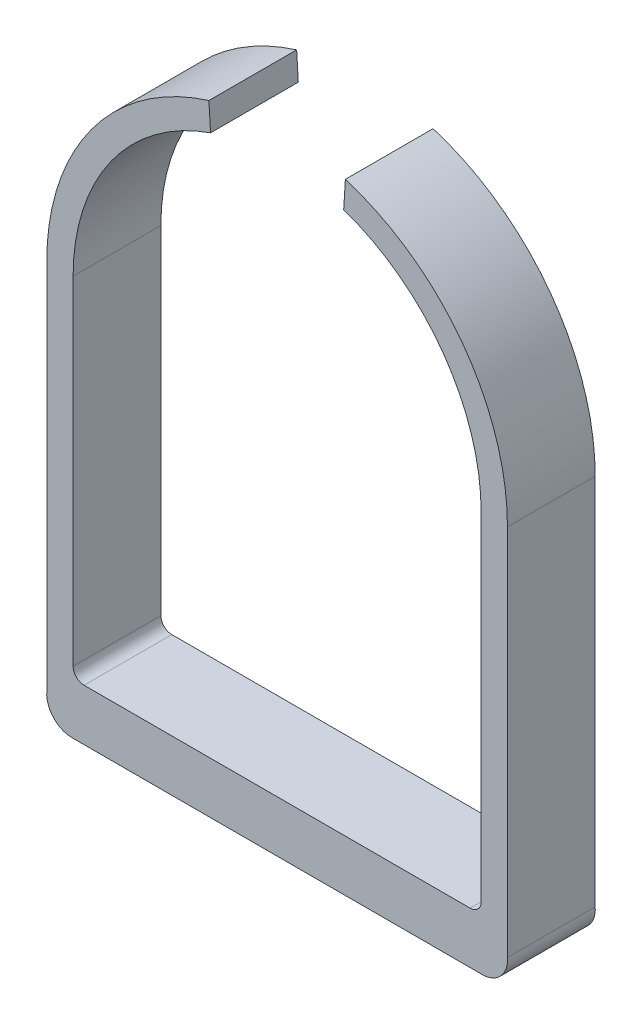
ISO-10303-21;
HEADER;
FILE_DESCRIPTION(('STEP AP214'),'2;1');
FILE_NAME('part.step','',(''),(''),'','','');
FILE_SCHEMA(('AUTOMOTIVE_DESIGN { 1 0 10303 214 1 1 1 1 }'));
ENDSEC;
DATA;
#1=APPLICATION_CONTEXT('core data for automotive mechanical design processes');
#2=APPLICATION_PROTOCOL_DEFINITION('international standard','automotive_design',2000,#1);
#3=PRODUCT_CONTEXT('',#1,'mechanical');
#4=PRODUCT('Part','Part','',(#3));
#5=PRODUCT_RELATED_PRODUCT_CATEGORY('part','',(#4));
#6=PRODUCT_DEFINITION_FORMATION('','',#4);
#7=PRODUCT_DEFINITION_CONTEXT('part definition',#1,'design');
#8=PRODUCT_DEFINITION('design','',#6,#7);
#9=PRODUCT_DEFINITION_SHAPE('','',#8);
#10=(LENGTH_UNIT() NAMED_UNIT(*) SI_UNIT(.MILLI.,.METRE.));
#11=(NAMED_UNIT(*) PLANE_ANGLE_UNIT() SI_UNIT($,.RADIAN.));
#12=(NAMED_UNIT(*) SI_UNIT($,.STERADIAN.) SOLID_ANGLE_UNIT());
#13=UNCERTAINTY_MEASURE_WITH_UNIT(LENGTH_MEASURE(1.E-05),#10,'distance_accuracy_value','');
#14=(GEOMETRIC_REPRESENTATION_CONTEXT(3) GLOBAL_UNCERTAINTY_ASSIGNED_CONTEXT((#13)) GLOBAL_UNIT_ASSIGNED_CONTEXT((#10,
#11,#12)) REPRESENTATION_CONTEXT('',''));
#15=CARTESIAN_POINT('',(0.,0.,0.));
#16=DIRECTION('',(0.,0.,1.));
#17=DIRECTION('',(1.,0.,0.));
#18=AXIS2_PLACEMENT_3D('',#15,#16,#17);
#19=CARTESIAN_POINT('',(0.,0.,56.8469714478884));
#20=DIRECTION('',(0.,0.,-1.));
#21=DIRECTION('',(-1.,0.,0.));
#22=AXIS2_PLACEMENT_3D('',#19,#20,#21);
#23=CYLINDRICAL_SURFACE('',#22,9.3);
#24=DIRECTION('',(0.,0.,-1.));
#25=VECTOR('',#24,1.);
#26=CARTESIAN_POINT('',(3.03467311666204,8.79094756411439,56.8469714478884));
#27=LINE('',#26,#25);
#28=CARTESIAN_POINT('',(3.03467311666204,8.79094756411439,1.5));
#29=VERTEX_POINT('',#28);
#30=CARTESIAN_POINT('',(3.03467311666204,8.79094756411439,5.5));
#31=VERTEX_POINT('',#30);
#32=EDGE_CURVE('E231',#29,#31,#27,.F.);
#33=ORIENTED_EDGE('',*,*,#32,.F.);
#34=CARTESIAN_POINT('',(0.,0.,1.5));
#35=DIRECTION('',(0.,0.,1.));
#36=DIRECTION('',(-1.,0.,0.));
#37=AXIS2_PLACEMENT_3D('',#34,#35,#36);
#38=CIRCLE('',#37,9.3);
#39=CARTESIAN_POINT('',(9.3,0.,1.5));
#40=VERTEX_POINT('',#39);
#41=EDGE_CURVE('E220',#40,#29,#38,.T.);
#42=ORIENTED_EDGE('',*,*,#41,.F.);
#43=DIRECTION('',(0.,0.,-1.));
#44=VECTOR('',#43,1.);
#45=CARTESIAN_POINT('',(9.3,0.,56.8469714478884));
#46=LINE('',#45,#44);
#47=CARTESIAN_POINT('',(9.3,0.,5.5));
#48=VERTEX_POINT('',#47);
#49=EDGE_CURVE('E11',#48,#40,#46,.T.);
#50=ORIENTED_EDGE('',*,*,#49,.F.);
#51=CARTESIAN_POINT('',(0.,0.,5.5));
#52=DIRECTION('',(0.,0.,1.));
#53=DIRECTION('',(1.,0.,0.));
#54=AXIS2_PLACEMENT_3D('',#51,#52,#53);
#55=CIRCLE('',#54,9.3);
#56=EDGE_CURVE('E243',#48,#31,#55,.T.);
#57=ORIENTED_EDGE('',*,*,#56,.T.);
#58=EDGE_LOOP('',(#33,#42,#50,#57));
#59=FACE_BOUND('',#58,.T.);
#60=ADVANCED_FACE('F48',(#59),#23,.F.);
#61=CARTESIAN_POINT('',(0.,0.,5.5));
#62=DIRECTION('',(0.,0.,1.));
#63=DIRECTION('',(1.,0.,0.));
#64=AXIS2_PLACEMENT_3D('',#61,#62,#63);
#65=PLANE('',#64);
#66=CARTESIAN_POINT('',(-9.34999999981468,-17.0923044273072,5.5));
#67=DIRECTION('',(0.,0.,1.));
#68=DIRECTION('',(1.,0.,0.));
#69=AXIS2_PLACEMENT_3D('',#66,#67,#68);
#70=CIRCLE('',#69,1.1536984474839);
#71=CARTESIAN_POINT('',(-9.34999999981468,-18.2460028747911,5.5));
#72=VERTEX_POINT('',#71);
#73=CARTESIAN_POINT('',(-10.5,-17.,5.5));
#74=VERTEX_POINT('',#73);
#75=EDGE_CURVE('E246',#72,#74,#70,.F.);
#76=ORIENTED_EDGE('',*,*,#75,.F.);
#77=DIRECTION('',(1.,0.,0.));
#78=VECTOR('',#77,1.);
#79=CARTESIAN_POINT('',(0.,-18.2460028747911,5.5));
#80=LINE('',#79,#78);
#81=CARTESIAN_POINT('',(9.35000000018532,-18.2460028747911,5.5));
#82=VERTEX_POINT('',#81);
#83=EDGE_CURVE('E261',#72,#82,#80,.T.);
#84=ORIENTED_EDGE('',*,*,#83,.T.);
#85=CARTESIAN_POINT('',(9.35000000018532,-17.0923044276493,5.5));
#86=DIRECTION('',(0.,0.,1.));
#87=DIRECTION('',(1.,0.,0.));
#88=AXIS2_PLACEMENT_3D('',#85,#86,#87);
#89=CIRCLE('',#88,1.15369844714181);
#90=CARTESIAN_POINT('',(10.5,-17.,5.5));
#91=VERTEX_POINT('',#90);
#92=EDGE_CURVE('E168',#82,#91,#89,.T.);
#93=ORIENTED_EDGE('',*,*,#92,.T.);
#94=DIRECTION('',(0.,-1.,0.));
#95=VECTOR('',#94,1.);
#96=CARTESIAN_POINT('',(10.5,0.,5.5));
#97=LINE('',#96,#95);
#98=CARTESIAN_POINT('',(10.5,0.,5.5));
#99=VERTEX_POINT('',#98);
#100=EDGE_CURVE('E248',#99,#91,#97,.T.);
#101=ORIENTED_EDGE('',*,*,#100,.F.);
#102=CARTESIAN_POINT('',(0.,0.,5.5));
#103=DIRECTION('',(0.,0.,1.));
#104=DIRECTION('',(1.,0.,0.));
#105=AXIS2_PLACEMENT_3D('',#102,#103,#104);
#106=CIRCLE('',#105,10.5);
#107=CARTESIAN_POINT('',(3.11032664956738,10.0287520725657,5.5));
#108=VERTEX_POINT('',#107);
#109=EDGE_CURVE('E250',#108,#99,#106,.F.);
#110=ORIENTED_EDGE('',*,*,#109,.F.);
#111=DIRECTION('',(-0.0610052906976046,-0.998137442693591,0.));
#112=VECTOR('',#111,1.);
#113=CARTESIAN_POINT('',(2.48808370636675,-0.15206950796001,5.5));
#114=LINE('',#113,#112);
#115=EDGE_CURVE('E256',#108,#31,#114,.T.);
#116=ORIENTED_EDGE('',*,*,#115,.T.);
#117=ORIENTED_EDGE('',*,*,#56,.F.);
#118=DIRECTION('',(0.,1.,0.));
#119=VECTOR('',#118,1.);
#120=CARTESIAN_POINT('',(9.3,0.,5.5));
#121=LINE('',#120,#119);
#122=CARTESIAN_POINT('',(9.3,-15.4,5.5));
#123=VERTEX_POINT('',#122);
#124=EDGE_CURVE('E70',#123,#48,#121,.T.);
#125=ORIENTED_EDGE('',*,*,#124,.F.);
#126=CARTESIAN_POINT('',(8.8,-15.4,5.5));
#127=DIRECTION('',(0.,0.,1.));
#128=DIRECTION('',(1.,0.,0.));
#129=AXIS2_PLACEMENT_3D('',#126,#127,#128);
#130=CIRCLE('',#129,0.5);
#131=CARTESIAN_POINT('',(8.8,-15.9,5.5));
#132=VERTEX_POINT('',#131);
#133=EDGE_CURVE('E267',#123,#132,#130,.F.);
#134=ORIENTED_EDGE('',*,*,#133,.T.);
#135=DIRECTION('',(1.,0.,0.));
#136=VECTOR('',#135,1.);
#137=CARTESIAN_POINT('',(0.,-15.9,5.5));
#138=LINE('',#137,#136);
#139=CARTESIAN_POINT('',(-8.8,-15.9,5.5));
#140=VERTEX_POINT('',#139);
#141=EDGE_CURVE('E239',#140,#132,#138,.T.);
#142=ORIENTED_EDGE('',*,*,#141,.F.);
#143=CARTESIAN_POINT('',(-8.8,-15.4,5.5));
#144=DIRECTION('',(0.,0.,1.));
#145=DIRECTION('',(1.,0.,0.));
#146=AXIS2_PLACEMENT_3D('',#143,#144,#145);
#147=CIRCLE('',#146,0.5);
#148=CARTESIAN_POINT('',(-9.3,-15.4,5.5));
#149=VERTEX_POINT('',#148);
#150=EDGE_CURVE('E234',#140,#149,#147,.F.);
#151=ORIENTED_EDGE('',*,*,#150,.T.);
#152=DIRECTION('',(0.,-1.,0.));
#153=VECTOR('',#152,1.);
#154=CARTESIAN_POINT('',(-9.3,-15.9,5.5));
#155=LINE('',#154,#153);
#156=CARTESIAN_POINT('',(-9.3,0.,5.5));
#157=VERTEX_POINT('',#156);
#158=EDGE_CURVE('E235',#157,#149,#155,.T.);
#159=ORIENTED_EDGE('',*,*,#158,.F.);
#160=CARTESIAN_POINT('',(-3.03467311644218,8.79094756419029,5.5));
#161=VERTEX_POINT('',#160);
#162=EDGE_CURVE('E63',#161,#157,#55,.T.);
#163=ORIENTED_EDGE('',*,*,#162,.F.);
#164=DIRECTION('',(-0.0610052909139107,0.99813744268037,0.));
#165=VECTOR('',#164,1.);
#166=CARTESIAN_POINT('',(-2.48808370417207,-0.152069508367079,5.5));
#167=LINE('',#166,#165);
#168=CARTESIAN_POINT('',(-3.11032664961128,10.0287520725521,5.5));
#169=VERTEX_POINT('',#168);
#170=EDGE_CURVE('E258',#161,#169,#167,.T.);
#171=ORIENTED_EDGE('',*,*,#170,.T.);
#172=CARTESIAN_POINT('',(0.,0.,5.5));
#173=DIRECTION('',(0.,0.,1.));
#174=DIRECTION('',(1.,0.,0.));
#175=AXIS2_PLACEMENT_3D('',#172,#173,#174);
#176=CIRCLE('',#175,10.5);
#177=CARTESIAN_POINT('',(-10.5,0.,5.5));
#178=VERTEX_POINT('',#177);
#179=EDGE_CURVE('E253',#178,#169,#176,.F.);
#180=ORIENTED_EDGE('',*,*,#179,.F.);
#181=DIRECTION('',(0.,-1.,0.));
#182=VECTOR('',#181,1.);
#183=CARTESIAN_POINT('',(-10.5,0.,5.5));
#184=LINE('',#183,#182);
#185=EDGE_CURVE('E264',#178,#74,#184,.T.);
#186=ORIENTED_EDGE('',*,*,#185,.T.);
#187=EDGE_LOOP('',(#76,#84,#93,#101,#110,#116,#117,#125,#134,#142,#151,#159,#163,#171,#180,#186));
#188=FACE_BOUND('',#187,.T.);
#189=ADVANCED_FACE('F325',(#188),#65,.T.);
#190=DIRECTION('',(0.,0.,-1.));
#191=VECTOR('',#190,1.);
#192=CARTESIAN_POINT('',(-3.03467311644218,8.79094756419029,56.8469714478884));
#193=LINE('',#192,#191);
#194=CARTESIAN_POINT('',(-3.03467311644218,8.79094756419029,1.5));
#195=VERTEX_POINT('',#194);
#196=EDGE_CURVE('E229',#161,#195,#193,.T.);
#197=ORIENTED_EDGE('',*,*,#196,.F.);
#198=ORIENTED_EDGE('',*,*,#162,.T.);
#199=DIRECTION('',(0.,0.,-1.));
#200=VECTOR('',#199,1.);
#201=CARTESIAN_POINT('',(-9.3,0.,56.8469714478884));
#202=LINE('',#201,#200);
#203=CARTESIAN_POINT('',(-9.3,0.,1.5));
#204=VERTEX_POINT('',#203);
#205=EDGE_CURVE('E56',#157,#204,#202,.T.);
#206=ORIENTED_EDGE('',*,*,#205,.T.);
#207=CARTESIAN_POINT('',(0.,0.,1.5));
#208=DIRECTION('',(0.,0.,1.));
#209=DIRECTION('',(-1.,0.,0.));
#210=AXIS2_PLACEMENT_3D('',#207,#208,#209);
#211=CIRCLE('',#210,9.3);
#212=EDGE_CURVE('E202',#195,#204,#211,.T.);
#213=ORIENTED_EDGE('',*,*,#212,.F.);
#214=EDGE_LOOP('',(#197,#198,#206,#213));
#215=FACE_BOUND('',#214,.T.);
#216=ADVANCED_FACE('F291',(#215),#23,.F.);
#217=CARTESIAN_POINT('',(-9.3,-15.9,56.8469714478884));
#218=DIRECTION('',(1.,0.,0.));
#219=DIRECTION('',(0.,0.,-1.));
#220=AXIS2_PLACEMENT_3D('',#217,#218,#219);
#221=PLANE('',#220);
#222=DIRECTION('',(0.,0.,-1.));
#223=VECTOR('',#222,1.);
#224=CARTESIAN_POINT('',(-9.3,-15.4,0.));
#225=LINE('',#224,#223);
#226=CARTESIAN_POINT('',(-9.3,-15.4,1.5));
#227=VERTEX_POINT('',#226);
#228=EDGE_CURVE('E238',#149,#227,#225,.T.);
#229=ORIENTED_EDGE('',*,*,#228,.T.);
#230=DIRECTION('',(0.,-1.,0.));
#231=VECTOR('',#230,1.);
#232=CARTESIAN_POINT('',(-9.3,0.,1.5));
#233=LINE('',#232,#231);
#234=EDGE_CURVE('E205',#204,#227,#233,.T.);
#235=ORIENTED_EDGE('',*,*,#234,.F.);
#236=ORIENTED_EDGE('',*,*,#205,.F.);
#237=ORIENTED_EDGE('',*,*,#158,.T.);
#238=EDGE_LOOP('',(#229,#235,#236,#237));
#239=FACE_BOUND('',#238,.T.);
#240=ADVANCED_FACE('F296',(#239),#221,.T.);
#241=CARTESIAN_POINT('',(0.,-15.9,56.8469714478884));
#242=DIRECTION('',(0.,1.,0.));
#243=DIRECTION('',(0.,0.,1.));
#244=AXIS2_PLACEMENT_3D('',#241,#242,#243);
#245=PLANE('',#244);
#246=DIRECTION('',(0.,0.,-1.));
#247=VECTOR('',#246,1.);
#248=CARTESIAN_POINT('',(8.8,-15.9,0.));
#249=LINE('',#248,#247);
#250=CARTESIAN_POINT('',(8.8,-15.9,1.5));
#251=VERTEX_POINT('',#250);
#252=EDGE_CURVE('E275',#132,#251,#249,.T.);
#253=ORIENTED_EDGE('',*,*,#252,.T.);
#254=DIRECTION('',(1.,0.,0.));
#255=VECTOR('',#254,1.);
#256=CARTESIAN_POINT('',(-8.8,-15.9,1.5));
#257=LINE('',#256,#255);
#258=CARTESIAN_POINT('',(-8.8,-15.9,1.5));
#259=VERTEX_POINT('',#258);
#260=EDGE_CURVE('E211',#259,#251,#257,.T.);
#261=ORIENTED_EDGE('',*,*,#260,.F.);
#262=DIRECTION('',(0.,0.,-1.));
#263=VECTOR('',#262,1.);
#264=CARTESIAN_POINT('',(-8.8,-15.9,6.02159565602451));
#265=LINE('',#264,#263);
#266=EDGE_CURVE('E173',#259,#140,#265,.F.);
#267=ORIENTED_EDGE('',*,*,#266,.T.);
#268=ORIENTED_EDGE('',*,*,#141,.T.);
#269=EDGE_LOOP('',(#253,#261,#267,#268));
#270=FACE_BOUND('',#269,.T.);
#271=ADVANCED_FACE('F303',(#270),#245,.T.);
#272=CARTESIAN_POINT('',(-8.8,-15.4,56.8469714478884));
#273=DIRECTION('',(0.,0.,1.));
#274=DIRECTION('',(1.,0.,0.));
#275=AXIS2_PLACEMENT_3D('',#272,#273,#274);
#276=CYLINDRICAL_SURFACE('',#275,0.5);
#277=ORIENTED_EDGE('',*,*,#266,.F.);
#278=CARTESIAN_POINT('',(-8.8,-15.4,1.5));
#279=DIRECTION('',(0.,0.,1.));
#280=DIRECTION('',(-1.,0.,0.));
#281=AXIS2_PLACEMENT_3D('',#278,#279,#280);
#282=CIRCLE('',#281,0.5);
#283=EDGE_CURVE('E208',#227,#259,#282,.T.);
#284=ORIENTED_EDGE('',*,*,#283,.F.);
#285=ORIENTED_EDGE('',*,*,#228,.F.);
#286=ORIENTED_EDGE('',*,*,#150,.F.);
#287=EDGE_LOOP('',(#277,#284,#285,#286));
#288=FACE_BOUND('',#287,.T.);
#289=ADVANCED_FACE('F299',(#288),#276,.F.);
#290=CARTESIAN_POINT('',(9.3,0.,56.8469714478884));
#291=DIRECTION('',(-1.,0.,0.));
#292=DIRECTION('',(0.,-1.,0.));
#293=AXIS2_PLACEMENT_3D('',#290,#291,#292);
#294=PLANE('',#293);
#295=ORIENTED_EDGE('',*,*,#49,.T.);
#296=DIRECTION('',(0.,1.,0.));
#297=VECTOR('',#296,1.);
#298=CARTESIAN_POINT('',(9.3,-15.4,1.5));
#299=LINE('',#298,#297);
#300=CARTESIAN_POINT('',(9.3,-15.4,1.5));
#301=VERTEX_POINT('',#300);
#302=EDGE_CURVE('E217',#301,#40,#299,.T.);
#303=ORIENTED_EDGE('',*,*,#302,.F.);
#304=DIRECTION('',(0.,0.,-1.));
#305=VECTOR('',#304,1.);
#306=CARTESIAN_POINT('',(9.3,-15.4,6.0215956560245));
#307=LINE('',#306,#305);
#308=EDGE_CURVE('E273',#301,#123,#307,.F.);
#309=ORIENTED_EDGE('',*,*,#308,.T.);
#310=ORIENTED_EDGE('',*,*,#124,.T.);
#311=EDGE_LOOP('',(#295,#303,#309,#310));
#312=FACE_BOUND('',#311,.T.);
#313=ADVANCED_FACE('F310',(#312),#294,.T.);
#314=CARTESIAN_POINT('',(8.8,-15.4,56.8469714478884));
#315=DIRECTION('',(0.,0.,1.));
#316=DIRECTION('',(1.,0.,0.));
#317=AXIS2_PLACEMENT_3D('',#314,#315,#316);
#318=CYLINDRICAL_SURFACE('',#317,0.5);
#319=ORIENTED_EDGE('',*,*,#308,.F.);
#320=CARTESIAN_POINT('',(8.8,-15.4,1.5));
#321=DIRECTION('',(0.,0.,1.));
#322=DIRECTION('',(-1.,0.,0.));
#323=AXIS2_PLACEMENT_3D('',#320,#321,#322);
#324=CIRCLE('',#323,0.5);
#325=EDGE_CURVE('E214',#251,#301,#324,.T.);
#326=ORIENTED_EDGE('',*,*,#325,.F.);
#327=ORIENTED_EDGE('',*,*,#252,.F.);
#328=ORIENTED_EDGE('',*,*,#133,.F.);
#329=EDGE_LOOP('',(#319,#326,#327,#328));
#330=FACE_BOUND('',#329,.T.);
#331=ADVANCED_FACE('F307',(#330),#318,.F.);
#332=CARTESIAN_POINT('',(2.48808370636675,-0.15206950796001,7.65));
#333=DIRECTION('',(0.998137442693591,-0.0610052906976046,0.));
#334=DIRECTION('',(0.0610052906976046,0.998137442693591,0.));
#335=AXIS2_PLACEMENT_3D('',#332,#333,#334);
#336=PLANE('',#335);
#337=DIRECTION('',(0.,0.,-1.));
#338=VECTOR('',#337,1.);
#339=CARTESIAN_POINT('',(3.11032664956738,10.0287520725657,7.65));
#340=LINE('',#339,#338);
#341=CARTESIAN_POINT('',(3.11032664956738,10.0287520725657,1.5));
#342=VERTEX_POINT('',#341);
#343=EDGE_CURVE('E281',#108,#342,#340,.T.);
#344=ORIENTED_EDGE('',*,*,#343,.T.);
#345=DIRECTION('',(0.0610052906976045,0.998137442693591,0.));
#346=VECTOR('',#345,1.);
#347=CARTESIAN_POINT('',(3.03467311666204,8.79094756411439,1.5));
#348=LINE('',#347,#346);
#349=EDGE_CURVE('E223',#29,#342,#348,.T.);
#350=ORIENTED_EDGE('',*,*,#349,.F.);
#351=ORIENTED_EDGE('',*,*,#32,.T.);
#352=ORIENTED_EDGE('',*,*,#115,.F.);
#353=EDGE_LOOP('',(#344,#350,#351,#352));
#354=FACE_BOUND('',#353,.T.);
#355=ADVANCED_FACE('F316',(#354),#336,.F.);
#356=CARTESIAN_POINT('',(0.,0.,7.65));
#357=DIRECTION('',(0.,0.,-1.));
#358=DIRECTION('',(-1.,0.,0.));
#359=AXIS2_PLACEMENT_3D('',#356,#357,#358);
#360=CYLINDRICAL_SURFACE('',#359,10.5);
#361=DIRECTION('',(0.,0.,-1.));
#362=VECTOR('',#361,1.);
#363=CARTESIAN_POINT('',(-3.11032664961128,10.0287520725521,7.65));
#364=LINE('',#363,#362);
#365=CARTESIAN_POINT('',(-3.11032664961128,10.0287520725521,1.5));
#366=VERTEX_POINT('',#365);
#367=EDGE_CURVE('E283',#169,#366,#364,.T.);
#368=ORIENTED_EDGE('',*,*,#367,.T.);
#369=CARTESIAN_POINT('',(0.,0.,1.5));
#370=DIRECTION('',(0.,0.,-1.));
#371=DIRECTION('',(-1.,0.,0.));
#372=AXIS2_PLACEMENT_3D('',#369,#370,#371);
#373=CIRCLE('',#372,10.5);
#374=CARTESIAN_POINT('',(-10.5,0.,1.5));
#375=VERTEX_POINT('',#374);
#376=EDGE_CURVE('E196',#375,#366,#373,.T.);
#377=ORIENTED_EDGE('',*,*,#376,.F.);
#378=DIRECTION('',(0.,0.,-1.));
#379=VECTOR('',#378,1.);
#380=CARTESIAN_POINT('',(-10.5,0.,7.65));
#381=LINE('',#380,#379);
#382=EDGE_CURVE('E285',#178,#375,#381,.T.);
#383=ORIENTED_EDGE('',*,*,#382,.F.);
#384=ORIENTED_EDGE('',*,*,#179,.T.);
#385=EDGE_LOOP('',(#368,#377,#383,#384));
#386=FACE_BOUND('',#385,.T.);
#387=ADVANCED_FACE('F336',(#386),#360,.T.);
#388=CARTESIAN_POINT('',(-10.5,0.,7.65));
#389=DIRECTION('',(1.,0.,0.));
#390=DIRECTION('',(0.,0.,-1.));
#391=AXIS2_PLACEMENT_3D('',#388,#389,#390);
#392=PLANE('',#391);
#393=ORIENTED_EDGE('',*,*,#382,.T.);
#394=DIRECTION('',(0.,1.,0.));
#395=VECTOR('',#394,1.);
#396=CARTESIAN_POINT('',(-10.5,-17.,1.5));
#397=LINE('',#396,#395);
#398=CARTESIAN_POINT('',(-10.5,-17.,1.5));
#399=VERTEX_POINT('',#398);
#400=EDGE_CURVE('E193',#399,#375,#397,.T.);
#401=ORIENTED_EDGE('',*,*,#400,.F.);
#402=DIRECTION('',(0.,0.,-1.));
#403=VECTOR('',#402,1.);
#404=CARTESIAN_POINT('',(-10.5,-17.,7.65));
#405=LINE('',#404,#403);
#406=EDGE_CURVE('E287',#74,#399,#405,.T.);
#407=ORIENTED_EDGE('',*,*,#406,.F.);
#408=ORIENTED_EDGE('',*,*,#185,.F.);
#409=EDGE_LOOP('',(#393,#401,#407,#408));
#410=FACE_BOUND('',#409,.T.);
#411=ADVANCED_FACE('F332',(#410),#392,.F.);
#412=CARTESIAN_POINT('',(0.,-18.2460028747911,7.65));
#413=DIRECTION('',(0.,1.,0.));
#414=DIRECTION('',(0.,0.,1.));
#415=AXIS2_PLACEMENT_3D('',#412,#413,#414);
#416=PLANE('',#415);
#417=DIRECTION('',(0.,0.,-1.));
#418=VECTOR('',#417,1.);
#419=CARTESIAN_POINT('',(-9.34999999981468,-18.2460028747911,7.65));
#420=LINE('',#419,#418);
#421=CARTESIAN_POINT('',(-9.34999999981468,-18.2460028747911,1.5));
#422=VERTEX_POINT('',#421);
#423=EDGE_CURVE('E179',#72,#422,#420,.T.);
#424=ORIENTED_EDGE('',*,*,#423,.T.);
#425=DIRECTION('',(-1.,0.,0.));
#426=VECTOR('',#425,1.);
#427=CARTESIAN_POINT('',(9.35000000018532,-18.2460028747911,1.5));
#428=LINE('',#427,#426);
#429=CARTESIAN_POINT('',(9.35000000018532,-18.2460028747911,1.5));
#430=VERTEX_POINT('',#429);
#431=EDGE_CURVE('E176',#430,#422,#428,.T.);
#432=ORIENTED_EDGE('',*,*,#431,.F.);
#433=DIRECTION('',(0.,0.,-1.));
#434=VECTOR('',#433,1.);
#435=CARTESIAN_POINT('',(9.35000000018532,-18.2460028747911,7.65));
#436=LINE('',#435,#434);
#437=EDGE_CURVE('E161',#82,#430,#436,.T.);
#438=ORIENTED_EDGE('',*,*,#437,.F.);
#439=ORIENTED_EDGE('',*,*,#83,.F.);
#440=EDGE_LOOP('',(#424,#432,#438,#439));
#441=FACE_BOUND('',#440,.T.);
#442=ADVANCED_FACE('F177',(#441),#416,.F.);
#443=CARTESIAN_POINT('',(-9.34999999981468,-17.0923044273072,7.65));
#444=DIRECTION('',(0.,0.,-1.));
#445=DIRECTION('',(-1.,0.,0.));
#446=AXIS2_PLACEMENT_3D('',#443,#444,#445);
#447=CYLINDRICAL_SURFACE('',#446,1.1536984474839);
#448=ORIENTED_EDGE('',*,*,#406,.T.);
#449=CARTESIAN_POINT('',(-9.34999999981468,-17.0923044273072,1.5));
#450=DIRECTION('',(0.,0.,-1.));
#451=DIRECTION('',(-1.,0.,0.));
#452=AXIS2_PLACEMENT_3D('',#449,#450,#451);
#453=CIRCLE('',#452,1.1536984474839);
#454=EDGE_CURVE('E183',#422,#399,#453,.T.);
#455=ORIENTED_EDGE('',*,*,#454,.F.);
#456=ORIENTED_EDGE('',*,*,#423,.F.);
#457=ORIENTED_EDGE('',*,*,#75,.T.);
#458=EDGE_LOOP('',(#448,#455,#456,#457));
#459=FACE_BOUND('',#458,.T.);
#460=ADVANCED_FACE('F327',(#459),#447,.T.);
#461=CARTESIAN_POINT('',(9.35000000018532,-17.0923044276493,7.65));
#462=DIRECTION('',(0.,0.,-1.));
#463=DIRECTION('',(-1.,0.,0.));
#464=AXIS2_PLACEMENT_3D('',#461,#462,#463);
#465=CYLINDRICAL_SURFACE('',#464,1.15369844714181);
#466=ORIENTED_EDGE('',*,*,#437,.T.);
#467=CARTESIAN_POINT('',(9.35000000018532,-17.0923044276493,1.5));
#468=DIRECTION('',(0.,0.,-1.));
#469=DIRECTION('',(-1.,0.,0.));
#470=AXIS2_PLACEMENT_3D('',#467,#468,#469);
#471=CIRCLE('',#470,1.15369844714181);
#472=CARTESIAN_POINT('',(10.5,-17.,1.5));
#473=VERTEX_POINT('',#472);
#474=EDGE_CURVE('E166',#473,#430,#471,.T.);
#475=ORIENTED_EDGE('',*,*,#474,.F.);
#476=DIRECTION('',(0.,0.,-1.));
#477=VECTOR('',#476,1.);
#478=CARTESIAN_POINT('',(10.5,-17.,7.65));
#479=LINE('',#478,#477);
#480=EDGE_CURVE('E172',#91,#473,#479,.T.);
#481=ORIENTED_EDGE('',*,*,#480,.F.);
#482=ORIENTED_EDGE('',*,*,#92,.F.);
#483=EDGE_LOOP('',(#466,#475,#481,#482));
#484=FACE_BOUND('',#483,.T.);
#485=ADVANCED_FACE('F163',(#484),#465,.T.);
#486=DIRECTION('',(0.,0.,-1.));
#487=VECTOR('',#486,1.);
#488=CARTESIAN_POINT('',(10.5,0.,7.65));
#489=LINE('',#488,#487);
#490=CARTESIAN_POINT('',(10.5,0.,1.5));
#491=VERTEX_POINT('',#490);
#492=EDGE_CURVE('E279',#99,#491,#489,.T.);
#493=ORIENTED_EDGE('',*,*,#492,.T.);
#494=CARTESIAN_POINT('',(0.,0.,1.5));
#495=DIRECTION('',(0.,0.,-1.));
#496=DIRECTION('',(-1.,0.,0.));
#497=AXIS2_PLACEMENT_3D('',#494,#495,#496);
#498=CIRCLE('',#497,10.5);
#499=EDGE_CURVE('E226',#342,#491,#498,.T.);
#500=ORIENTED_EDGE('',*,*,#499,.F.);
#501=ORIENTED_EDGE('',*,*,#343,.F.);
#502=ORIENTED_EDGE('',*,*,#109,.T.);
#503=EDGE_LOOP('',(#493,#500,#501,#502));
#504=FACE_BOUND('',#503,.T.);
#505=ADVANCED_FACE('F320',(#504),#360,.T.);
#506=CARTESIAN_POINT('',(10.5,0.,7.65));
#507=DIRECTION('',(1.,0.,0.));
#508=DIRECTION('',(0.,1.,0.));
#509=AXIS2_PLACEMENT_3D('',#506,#507,#508);
#510=PLANE('',#509);
#511=ORIENTED_EDGE('',*,*,#480,.T.);
#512=DIRECTION('',(0.,-1.,0.));
#513=VECTOR('',#512,1.);
#514=CARTESIAN_POINT('',(10.5,0.,1.5));
#515=LINE('',#514,#513);
#516=EDGE_CURVE('E189',#491,#473,#515,.T.);
#517=ORIENTED_EDGE('',*,*,#516,.F.);
#518=ORIENTED_EDGE('',*,*,#492,.F.);
#519=ORIENTED_EDGE('',*,*,#100,.T.);
#520=EDGE_LOOP('',(#511,#517,#518,#519));
#521=FACE_BOUND('',#520,.T.);
#522=ADVANCED_FACE('F323',(#521),#510,.T.);
#523=CARTESIAN_POINT('',(-2.48808370417207,-0.152069508367079,7.65));
#524=DIRECTION('',(-0.99813744268037,-0.0610052909139107,0.));
#525=DIRECTION('',(0.0610052909139107,-0.99813744268037,0.));
#526=AXIS2_PLACEMENT_3D('',#523,#524,#525);
#527=PLANE('',#526);
#528=ORIENTED_EDGE('',*,*,#170,.F.);
#529=ORIENTED_EDGE('',*,*,#196,.T.);
#530=DIRECTION('',(0.0610052909138892,-0.998137442680372,0.));
#531=VECTOR('',#530,1.);
#532=CARTESIAN_POINT('',(-3.11032664961128,10.0287520725521,1.5));
#533=LINE('',#532,#531);
#534=EDGE_CURVE('E199',#366,#195,#533,.T.);
#535=ORIENTED_EDGE('',*,*,#534,.F.);
#536=ORIENTED_EDGE('',*,*,#367,.F.);
#537=EDGE_LOOP('',(#528,#529,#535,#536));
#538=FACE_BOUND('',#537,.T.);
#539=ADVANCED_FACE('F50',(#538),#527,.F.);
#540=CARTESIAN_POINT('',(9.35000000018532,-17.0923044276493,1.5));
#541=DIRECTION('',(0.,0.,-1.));
#542=DIRECTION('',(-1.,0.,0.));
#543=AXIS2_PLACEMENT_3D('',#540,#541,#542);
#544=PLANE('',#543);
#545=ORIENTED_EDGE('',*,*,#474,.T.);
#546=ORIENTED_EDGE('',*,*,#431,.T.);
#547=ORIENTED_EDGE('',*,*,#454,.T.);
#548=ORIENTED_EDGE('',*,*,#400,.T.);
#549=ORIENTED_EDGE('',*,*,#376,.T.);
#550=ORIENTED_EDGE('',*,*,#534,.T.);
#551=ORIENTED_EDGE('',*,*,#212,.T.);
#552=ORIENTED_EDGE('',*,*,#234,.T.);
#553=ORIENTED_EDGE('',*,*,#283,.T.);
#554=ORIENTED_EDGE('',*,*,#260,.T.);
#555=ORIENTED_EDGE('',*,*,#325,.T.);
#556=ORIENTED_EDGE('',*,*,#302,.T.);
#557=ORIENTED_EDGE('',*,*,#41,.T.);
#558=ORIENTED_EDGE('',*,*,#349,.T.);
#559=ORIENTED_EDGE('',*,*,#499,.T.);
#560=ORIENTED_EDGE('',*,*,#516,.T.);
#561=EDGE_LOOP('',(#545,#546,#547,#548,#549,#550,#551,#552,#553,#554,#555,#556,#557,#558,#559,#560));
#562=FACE_BOUND('',#561,.T.);
#563=ADVANCED_FACE('F186',(#562),#544,.T.);
#564=CLOSED_SHELL('',(#60,#189,#216,#240,#271,#289,#313,#331,#355,#387,#411,#442,#460,#485,#505,
#522,#539,#563));
#565=MANIFOLD_SOLID_BREP('B2',#564);
#566=ADVANCED_BREP_SHAPE_REPRESENTATION('',(#18,#565),#14);
#567=SHAPE_DEFINITION_REPRESENTATION(#9,#566);
ENDSEC;
END-ISO-10303-21;
